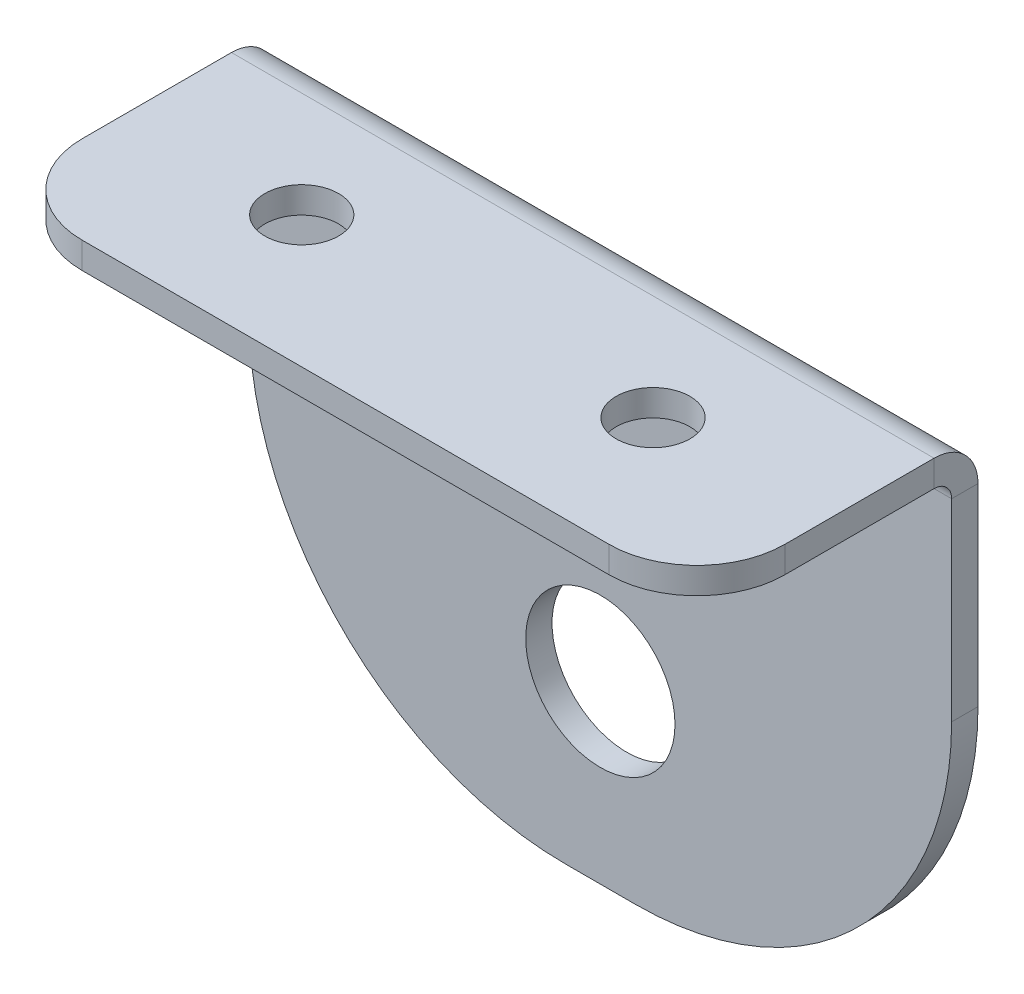
ISO-10303-21;
HEADER;
FILE_DESCRIPTION(('STEP AP214'),'2;1');
FILE_NAME('part.step','',(''),(''),'','','');
FILE_SCHEMA(('AUTOMOTIVE_DESIGN { 1 0 10303 214 1 1 1 1 }'));
ENDSEC;
DATA;
#1=APPLICATION_CONTEXT('core data for automotive mechanical design processes');
#2=APPLICATION_PROTOCOL_DEFINITION('international standard','automotive_design',2000,#1);
#3=PRODUCT_CONTEXT('',#1,'mechanical');
#4=PRODUCT('Part','Part','',(#3));
#5=PRODUCT_RELATED_PRODUCT_CATEGORY('part','',(#4));
#6=PRODUCT_DEFINITION_FORMATION('','',#4);
#7=PRODUCT_DEFINITION_CONTEXT('part definition',#1,'design');
#8=PRODUCT_DEFINITION('design','',#6,#7);
#9=PRODUCT_DEFINITION_SHAPE('','',#8);
#10=(LENGTH_UNIT() NAMED_UNIT(*) SI_UNIT(.MILLI.,.METRE.));
#11=(NAMED_UNIT(*) PLANE_ANGLE_UNIT() SI_UNIT($,.RADIAN.));
#12=(NAMED_UNIT(*) SI_UNIT($,.STERADIAN.) SOLID_ANGLE_UNIT());
#13=UNCERTAINTY_MEASURE_WITH_UNIT(LENGTH_MEASURE(1.E-05),#10,'distance_accuracy_value','');
#14=(GEOMETRIC_REPRESENTATION_CONTEXT(3) GLOBAL_UNCERTAINTY_ASSIGNED_CONTEXT((#13)) GLOBAL_UNIT_ASSIGNED_CONTEXT((#10,
#11,#12)) REPRESENTATION_CONTEXT('',''));
#15=CARTESIAN_POINT('',(0.,0.,0.));
#16=DIRECTION('',(0.,0.,1.));
#17=DIRECTION('',(1.,0.,0.));
#18=AXIS2_PLACEMENT_3D('',#15,#16,#17);
#19=CARTESIAN_POINT('',(-20.,21.5,-1.5));
#20=DIRECTION('',(-1.,0.,0.));
#21=DIRECTION('',(0.,-1.,0.));
#22=AXIS2_PLACEMENT_3D('',#19,#20,#21);
#23=PLANE('',#22);
#24=DIRECTION('',(0.,-1.,0.));
#25=VECTOR('',#24,1.);
#26=CARTESIAN_POINT('',(-20.,21.5,0.));
#27=LINE('',#26,#25);
#28=CARTESIAN_POINT('',(-20.,19.,0.));
#29=VERTEX_POINT('',#28);
#30=CARTESIAN_POINT('',(-20.,8.,0.));
#31=VERTEX_POINT('',#30);
#32=EDGE_CURVE('E254',#29,#31,#27,.T.);
#33=ORIENTED_EDGE('',*,*,#32,.F.);
#34=DIRECTION('',(0.,0.,-1.));
#35=VECTOR('',#34,1.);
#36=CARTESIAN_POINT('',(-20.,19.,0.));
#37=LINE('',#36,#35);
#38=CARTESIAN_POINT('',(-20.,19.,-1.5));
#39=VERTEX_POINT('',#38);
#40=EDGE_CURVE('E235',#29,#39,#37,.T.);
#41=ORIENTED_EDGE('',*,*,#40,.T.);
#42=DIRECTION('',(0.,-1.,0.));
#43=VECTOR('',#42,1.);
#44=CARTESIAN_POINT('',(-20.,21.5,-1.5));
#45=LINE('',#44,#43);
#46=CARTESIAN_POINT('',(-20.,8.,-1.5));
#47=VERTEX_POINT('',#46);
#48=EDGE_CURVE('E120',#39,#47,#45,.T.);
#49=ORIENTED_EDGE('',*,*,#48,.T.);
#50=DIRECTION('',(0.,0.,1.));
#51=VECTOR('',#50,1.);
#52=CARTESIAN_POINT('',(-20.,8.,-1.5));
#53=LINE('',#52,#51);
#54=EDGE_CURVE('E74',#47,#31,#53,.T.);
#55=ORIENTED_EDGE('',*,*,#54,.T.);
#56=EDGE_LOOP('',(#33,#41,#49,#55));
#57=FACE_BOUND('',#56,.T.);
#58=ADVANCED_FACE('F71',(#57),#23,.T.);
#59=CARTESIAN_POINT('',(-2.,8.,-1.5));
#60=DIRECTION('',(0.,0.,1.));
#61=DIRECTION('',(1.,0.,0.));
#62=AXIS2_PLACEMENT_3D('',#59,#60,#61);
#63=PLANE('',#62);
#64=CARTESIAN_POINT('',(0.,0.,-1.5));
#65=DIRECTION('',(0.,0.,1.));
#66=DIRECTION('',(1.,0.,0.));
#67=AXIS2_PLACEMENT_3D('',#64,#65,#66);
#68=CIRCLE('',#67,4.25);
#69=CARTESIAN_POINT('',(4.25,0.,-1.5));
#70=VERTEX_POINT('',#69);
#71=EDGE_CURVE('E251',#70,#70,#68,.T.);
#72=ORIENTED_EDGE('',*,*,#71,.T.);
#73=EDGE_LOOP('',(#72));
#74=FACE_BOUND('',#73,.T.);
#75=DIRECTION('',(-1.,0.,0.));
#76=VECTOR('',#75,1.);
#77=CARTESIAN_POINT('',(-20.,19.,-1.5));
#78=LINE('',#77,#76);
#79=CARTESIAN_POINT('',(20.,19.,-1.5));
#80=VERTEX_POINT('',#79);
#81=EDGE_CURVE('E229',#39,#80,#78,.F.);
#82=ORIENTED_EDGE('',*,*,#81,.T.);
#83=DIRECTION('',(0.,1.,0.));
#84=VECTOR('',#83,1.);
#85=CARTESIAN_POINT('',(20.,21.5,-1.5));
#86=LINE('',#85,#84);
#87=CARTESIAN_POINT('',(20.,8.,-1.5));
#88=VERTEX_POINT('',#87);
#89=EDGE_CURVE('E267',#88,#80,#86,.T.);
#90=ORIENTED_EDGE('',*,*,#89,.F.);
#91=CARTESIAN_POINT('',(2.,8.,-1.5));
#92=DIRECTION('',(0.,0.,1.));
#93=DIRECTION('',(1.,0.,0.));
#94=AXIS2_PLACEMENT_3D('',#91,#92,#93);
#95=CIRCLE('',#94,18.);
#96=CARTESIAN_POINT('',(2.,-10.,-1.5));
#97=VERTEX_POINT('',#96);
#98=EDGE_CURVE('E265',#97,#88,#95,.T.);
#99=ORIENTED_EDGE('',*,*,#98,.F.);
#100=DIRECTION('',(1.,0.,0.));
#101=VECTOR('',#100,1.);
#102=CARTESIAN_POINT('',(-2.,-10.,-1.5));
#103=LINE('',#102,#101);
#104=CARTESIAN_POINT('',(-2.,-10.,-1.5));
#105=VERTEX_POINT('',#104);
#106=EDGE_CURVE('E262',#105,#97,#103,.T.);
#107=ORIENTED_EDGE('',*,*,#106,.F.);
#108=CARTESIAN_POINT('',(-2.,8.,-1.5));
#109=DIRECTION('',(0.,0.,1.));
#110=DIRECTION('',(1.,0.,0.));
#111=AXIS2_PLACEMENT_3D('',#108,#109,#110);
#112=CIRCLE('',#111,18.);
#113=EDGE_CURVE('E258',#47,#105,#112,.T.);
#114=ORIENTED_EDGE('',*,*,#113,.F.);
#115=ORIENTED_EDGE('',*,*,#48,.F.);
#116=EDGE_LOOP('',(#82,#90,#99,#107,#114,#115));
#117=FACE_BOUND('',#116,.T.);
#118=ADVANCED_FACE('F303',(#74,#117),#63,.F.);
#119=CARTESIAN_POINT('',(-2.,8.,0.));
#120=DIRECTION('',(0.,0.,1.));
#121=DIRECTION('',(1.,0.,0.));
#122=AXIS2_PLACEMENT_3D('',#119,#120,#121);
#123=PLANE('',#122);
#124=CARTESIAN_POINT('',(0.,0.,0.));
#125=DIRECTION('',(0.,0.,1.));
#126=DIRECTION('',(1.,0.,0.));
#127=AXIS2_PLACEMENT_3D('',#124,#125,#126);
#128=CIRCLE('',#127,4.25);
#129=CARTESIAN_POINT('',(4.25,0.,0.));
#130=VERTEX_POINT('',#129);
#131=EDGE_CURVE('E249',#130,#130,#128,.T.);
#132=ORIENTED_EDGE('',*,*,#131,.F.);
#133=EDGE_LOOP('',(#132));
#134=FACE_BOUND('',#133,.T.);
#135=DIRECTION('',(0.,1.,0.));
#136=VECTOR('',#135,1.);
#137=CARTESIAN_POINT('',(20.,21.5,0.));
#138=LINE('',#137,#136);
#139=CARTESIAN_POINT('',(20.,8.,0.));
#140=VERTEX_POINT('',#139);
#141=CARTESIAN_POINT('',(20.,19.,0.));
#142=VERTEX_POINT('',#141);
#143=EDGE_CURVE('E259',#140,#142,#138,.T.);
#144=ORIENTED_EDGE('',*,*,#143,.T.);
#145=DIRECTION('',(-1.,0.,0.));
#146=VECTOR('',#145,1.);
#147=CARTESIAN_POINT('',(-20.,19.,0.));
#148=LINE('',#147,#146);
#149=EDGE_CURVE('E87',#29,#142,#148,.F.);
#150=ORIENTED_EDGE('',*,*,#149,.F.);
#151=ORIENTED_EDGE('',*,*,#32,.T.);
#152=CARTESIAN_POINT('',(-2.,8.,0.));
#153=DIRECTION('',(0.,0.,1.));
#154=DIRECTION('',(1.,0.,0.));
#155=AXIS2_PLACEMENT_3D('',#152,#153,#154);
#156=CIRCLE('',#155,18.);
#157=CARTESIAN_POINT('',(-2.,-10.,0.));
#158=VERTEX_POINT('',#157);
#159=EDGE_CURVE('E270',#31,#158,#156,.T.);
#160=ORIENTED_EDGE('',*,*,#159,.T.);
#161=DIRECTION('',(1.,0.,0.));
#162=VECTOR('',#161,1.);
#163=CARTESIAN_POINT('',(-2.,-10.,0.));
#164=LINE('',#163,#162);
#165=CARTESIAN_POINT('',(2.,-10.,0.));
#166=VERTEX_POINT('',#165);
#167=EDGE_CURVE('E273',#158,#166,#164,.T.);
#168=ORIENTED_EDGE('',*,*,#167,.T.);
#169=CARTESIAN_POINT('',(2.,8.,0.));
#170=DIRECTION('',(0.,0.,1.));
#171=DIRECTION('',(1.,0.,0.));
#172=AXIS2_PLACEMENT_3D('',#169,#170,#171);
#173=CIRCLE('',#172,18.);
#174=EDGE_CURVE('E276',#166,#140,#173,.T.);
#175=ORIENTED_EDGE('',*,*,#174,.T.);
#176=EDGE_LOOP('',(#144,#150,#151,#160,#168,#175));
#177=FACE_BOUND('',#176,.T.);
#178=ADVANCED_FACE('F287',(#134,#177),#123,.T.);
#179=CARTESIAN_POINT('',(20.,21.5,-1.5));
#180=DIRECTION('',(1.,0.,0.));
#181=DIRECTION('',(0.,1.,0.));
#182=AXIS2_PLACEMENT_3D('',#179,#180,#181);
#183=PLANE('',#182);
#184=DIRECTION('',(0.,0.,-1.));
#185=VECTOR('',#184,1.);
#186=CARTESIAN_POINT('',(20.,19.,0.));
#187=LINE('',#186,#185);
#188=EDGE_CURVE('E246',#142,#80,#187,.T.);
#189=ORIENTED_EDGE('',*,*,#188,.F.);
#190=ORIENTED_EDGE('',*,*,#143,.F.);
#191=DIRECTION('',(0.,0.,1.));
#192=VECTOR('',#191,1.);
#193=CARTESIAN_POINT('',(20.,8.,-1.5));
#194=LINE('',#193,#192);
#195=EDGE_CURVE('E13',#88,#140,#194,.T.);
#196=ORIENTED_EDGE('',*,*,#195,.F.);
#197=ORIENTED_EDGE('',*,*,#89,.T.);
#198=EDGE_LOOP('',(#189,#190,#196,#197));
#199=FACE_BOUND('',#198,.T.);
#200=ADVANCED_FACE('F294',(#199),#183,.T.);
#201=CARTESIAN_POINT('',(2.,8.,-1.5));
#202=DIRECTION('',(0.,0.,1.));
#203=DIRECTION('',(1.,0.,0.));
#204=AXIS2_PLACEMENT_3D('',#201,#202,#203);
#205=CYLINDRICAL_SURFACE('',#204,18.);
#206=ORIENTED_EDGE('',*,*,#174,.F.);
#207=DIRECTION('',(0.,0.,1.));
#208=VECTOR('',#207,1.);
#209=CARTESIAN_POINT('',(2.,-10.,-1.5));
#210=LINE('',#209,#208);
#211=EDGE_CURVE('E79',#97,#166,#210,.T.);
#212=ORIENTED_EDGE('',*,*,#211,.F.);
#213=ORIENTED_EDGE('',*,*,#98,.T.);
#214=ORIENTED_EDGE('',*,*,#195,.T.);
#215=EDGE_LOOP('',(#206,#212,#213,#214));
#216=FACE_BOUND('',#215,.T.);
#217=ADVANCED_FACE('F292',(#216),#205,.T.);
#218=CARTESIAN_POINT('',(-2.,-10.,-1.5));
#219=DIRECTION('',(0.,-1.,0.));
#220=DIRECTION('',(0.,0.,-1.));
#221=AXIS2_PLACEMENT_3D('',#218,#219,#220);
#222=PLANE('',#221);
#223=ORIENTED_EDGE('',*,*,#167,.F.);
#224=DIRECTION('',(0.,0.,1.));
#225=VECTOR('',#224,1.);
#226=CARTESIAN_POINT('',(-2.,-10.,-1.5));
#227=LINE('',#226,#225);
#228=EDGE_CURVE('E280',#105,#158,#227,.T.);
#229=ORIENTED_EDGE('',*,*,#228,.F.);
#230=ORIENTED_EDGE('',*,*,#106,.T.);
#231=ORIENTED_EDGE('',*,*,#211,.T.);
#232=EDGE_LOOP('',(#223,#229,#230,#231));
#233=FACE_BOUND('',#232,.T.);
#234=ADVANCED_FACE('F289',(#233),#222,.T.);
#235=CARTESIAN_POINT('',(-2.,8.,-1.5));
#236=DIRECTION('',(0.,0.,1.));
#237=DIRECTION('',(1.,0.,0.));
#238=AXIS2_PLACEMENT_3D('',#235,#236,#237);
#239=CYLINDRICAL_SURFACE('',#238,18.);
#240=ORIENTED_EDGE('',*,*,#159,.F.);
#241=ORIENTED_EDGE('',*,*,#54,.F.);
#242=ORIENTED_EDGE('',*,*,#113,.T.);
#243=ORIENTED_EDGE('',*,*,#228,.T.);
#244=EDGE_LOOP('',(#240,#241,#242,#243));
#245=FACE_BOUND('',#244,.T.);
#246=ADVANCED_FACE('F286',(#245),#239,.T.);
#247=CARTESIAN_POINT('',(0.,0.,-1.5));
#248=DIRECTION('',(0.,0.,1.));
#249=DIRECTION('',(1.,0.,0.));
#250=AXIS2_PLACEMENT_3D('',#247,#248,#249);
#251=CYLINDRICAL_SURFACE('',#250,4.25);
#252=ORIENTED_EDGE('',*,*,#71,.F.);
#253=EDGE_LOOP('',(#252));
#254=FACE_BOUND('',#253,.T.);
#255=ORIENTED_EDGE('',*,*,#131,.T.);
#256=EDGE_LOOP('',(#255));
#257=FACE_BOUND('',#256,.T.);
#258=ADVANCED_FACE('F316',(#254,#257),#251,.F.);
#259=CARTESIAN_POINT('',(20.,19.,1.));
#260=DIRECTION('',(1.,0.,0.));
#261=DIRECTION('',(0.,0.,-1.));
#262=AXIS2_PLACEMENT_3D('',#259,#260,#261);
#263=PLANE('',#262);
#264=DIRECTION('',(0.,-1.,0.));
#265=VECTOR('',#264,1.);
#266=CARTESIAN_POINT('',(20.,21.5,0.999999999999992));
#267=LINE('',#266,#265);
#268=CARTESIAN_POINT('',(20.,20.,0.999999999999997));
#269=VERTEX_POINT('',#268);
#270=CARTESIAN_POINT('',(20.,21.5,0.999999999999992));
#271=VERTEX_POINT('',#270);
#272=EDGE_CURVE('E193',#269,#271,#267,.F.);
#273=ORIENTED_EDGE('',*,*,#272,.F.);
#274=CARTESIAN_POINT('',(20.,19.,1.));
#275=DIRECTION('',(-1.,0.,0.));
#276=DIRECTION('',(0.,0.,1.));
#277=AXIS2_PLACEMENT_3D('',#274,#275,#276);
#278=CIRCLE('',#277,1.);
#279=EDGE_CURVE('E238',#142,#269,#278,.F.);
#280=ORIENTED_EDGE('',*,*,#279,.F.);
#281=ORIENTED_EDGE('',*,*,#188,.T.);
#282=CARTESIAN_POINT('',(20.,19.,1.));
#283=DIRECTION('',(-1.,0.,0.));
#284=DIRECTION('',(0.,0.,1.));
#285=AXIS2_PLACEMENT_3D('',#282,#283,#284);
#286=CIRCLE('',#285,2.5);
#287=EDGE_CURVE('E231',#80,#271,#286,.F.);
#288=ORIENTED_EDGE('',*,*,#287,.T.);
#289=EDGE_LOOP('',(#273,#280,#281,#288));
#290=FACE_BOUND('',#289,.T.);
#291=ADVANCED_FACE('F319',(#290),#263,.T.);
#292=CARTESIAN_POINT('',(-20.,19.,1.));
#293=DIRECTION('',(1.,0.,0.));
#294=DIRECTION('',(0.,0.,-1.));
#295=AXIS2_PLACEMENT_3D('',#292,#293,#294);
#296=PLANE('',#295);
#297=CARTESIAN_POINT('',(-20.,19.,1.));
#298=DIRECTION('',(-1.,0.,0.));
#299=DIRECTION('',(0.,0.,1.));
#300=AXIS2_PLACEMENT_3D('',#297,#298,#299);
#301=CIRCLE('',#300,1.);
#302=CARTESIAN_POINT('',(-20.,20.,1.));
#303=VERTEX_POINT('',#302);
#304=EDGE_CURVE('E242',#303,#29,#301,.T.);
#305=ORIENTED_EDGE('',*,*,#304,.F.);
#306=DIRECTION('',(0.,-1.,0.));
#307=VECTOR('',#306,1.);
#308=CARTESIAN_POINT('',(-20.,20.,1.));
#309=LINE('',#308,#307);
#310=CARTESIAN_POINT('',(-20.,21.5,0.999999999999996));
#311=VERTEX_POINT('',#310);
#312=EDGE_CURVE('E223',#303,#311,#309,.F.);
#313=ORIENTED_EDGE('',*,*,#312,.T.);
#314=CARTESIAN_POINT('',(-20.,19.,1.));
#315=DIRECTION('',(-1.,0.,0.));
#316=DIRECTION('',(0.,0.,1.));
#317=AXIS2_PLACEMENT_3D('',#314,#315,#316);
#318=CIRCLE('',#317,2.5);
#319=EDGE_CURVE('E232',#311,#39,#318,.T.);
#320=ORIENTED_EDGE('',*,*,#319,.T.);
#321=ORIENTED_EDGE('',*,*,#40,.F.);
#322=EDGE_LOOP('',(#305,#313,#320,#321));
#323=FACE_BOUND('',#322,.T.);
#324=ADVANCED_FACE('F321',(#323),#296,.F.);
#325=CARTESIAN_POINT('',(-20.,19.,1.));
#326=DIRECTION('',(-1.,0.,0.));
#327=DIRECTION('',(0.,1.,0.));
#328=AXIS2_PLACEMENT_3D('',#325,#326,#327);
#329=CYLINDRICAL_SURFACE('',#328,2.5);
#330=ORIENTED_EDGE('',*,*,#81,.F.);
#331=ORIENTED_EDGE('',*,*,#319,.F.);
#332=DIRECTION('',(-1.,0.,0.));
#333=VECTOR('',#332,1.);
#334=CARTESIAN_POINT('',(20.,21.5,0.999999999999992));
#335=LINE('',#334,#333);
#336=EDGE_CURVE('E221',#311,#271,#335,.F.);
#337=ORIENTED_EDGE('',*,*,#336,.T.);
#338=ORIENTED_EDGE('',*,*,#287,.F.);
#339=EDGE_LOOP('',(#330,#331,#337,#338));
#340=FACE_BOUND('',#339,.T.);
#341=ADVANCED_FACE('F324',(#340),#329,.T.);
#342=CARTESIAN_POINT('',(-20.,19.,1.));
#343=DIRECTION('',(-1.,0.,0.));
#344=DIRECTION('',(0.,1.,0.));
#345=AXIS2_PLACEMENT_3D('',#342,#343,#344);
#346=CYLINDRICAL_SURFACE('',#345,1.);
#347=ORIENTED_EDGE('',*,*,#149,.T.);
#348=ORIENTED_EDGE('',*,*,#279,.T.);
#349=DIRECTION('',(-1.,0.,0.));
#350=VECTOR('',#349,1.);
#351=CARTESIAN_POINT('',(20.,20.,0.999999999999997));
#352=LINE('',#351,#350);
#353=EDGE_CURVE('E226',#269,#303,#352,.T.);
#354=ORIENTED_EDGE('',*,*,#353,.T.);
#355=ORIENTED_EDGE('',*,*,#304,.T.);
#356=EDGE_LOOP('',(#347,#348,#354,#355));
#357=FACE_BOUND('',#356,.T.);
#358=ADVANCED_FACE('F329',(#357),#346,.F.);
#359=CARTESIAN_POINT('',(15.,21.5,9.5));
#360=DIRECTION('',(0.,-1.,0.));
#361=DIRECTION('',(0.,0.,-1.));
#362=AXIS2_PLACEMENT_3D('',#359,#360,#361);
#363=PLANE('',#362);
#364=CARTESIAN_POINT('',(-10.,21.5,7.));
#365=DIRECTION('',(0.,-1.,0.));
#366=DIRECTION('',(0.,0.,-1.));
#367=AXIS2_PLACEMENT_3D('',#364,#365,#366);
#368=CIRCLE('',#367,2.1);
#369=CARTESIAN_POINT('',(-10.,21.5,4.9));
#370=VERTEX_POINT('',#369);
#371=EDGE_CURVE('E215',#370,#370,#368,.F.);
#372=ORIENTED_EDGE('',*,*,#371,.F.);
#373=EDGE_LOOP('',(#372));
#374=FACE_BOUND('',#373,.T.);
#375=CARTESIAN_POINT('',(10.,21.5,7.));
#376=DIRECTION('',(0.,-1.,0.));
#377=DIRECTION('',(0.,0.,-1.));
#378=AXIS2_PLACEMENT_3D('',#375,#376,#377);
#379=CIRCLE('',#378,2.1);
#380=CARTESIAN_POINT('',(10.,21.5,4.9));
#381=VERTEX_POINT('',#380);
#382=EDGE_CURVE('E209',#381,#381,#379,.F.);
#383=ORIENTED_EDGE('',*,*,#382,.F.);
#384=EDGE_LOOP('',(#383));
#385=FACE_BOUND('',#384,.T.);
#386=ORIENTED_EDGE('',*,*,#336,.F.);
#387=DIRECTION('',(0.,0.,1.));
#388=VECTOR('',#387,1.);
#389=CARTESIAN_POINT('',(-20.,21.5,9.5));
#390=LINE('',#389,#388);
#391=CARTESIAN_POINT('',(-20.,21.5,9.49999999999998));
#392=VERTEX_POINT('',#391);
#393=EDGE_CURVE('E194',#311,#392,#390,.T.);
#394=ORIENTED_EDGE('',*,*,#393,.T.);
#395=CARTESIAN_POINT('',(-15.,21.5,9.5));
#396=DIRECTION('',(0.,-1.,0.));
#397=DIRECTION('',(0.,0.,-1.));
#398=AXIS2_PLACEMENT_3D('',#395,#396,#397);
#399=CIRCLE('',#398,5.);
#400=CARTESIAN_POINT('',(-15.,21.5,14.5));
#401=VERTEX_POINT('',#400);
#402=EDGE_CURVE('E196',#392,#401,#399,.F.);
#403=ORIENTED_EDGE('',*,*,#402,.T.);
#404=DIRECTION('',(1.,0.,0.));
#405=VECTOR('',#404,1.);
#406=CARTESIAN_POINT('',(15.,21.5,14.5));
#407=LINE('',#406,#405);
#408=CARTESIAN_POINT('',(15.,21.5,14.5));
#409=VERTEX_POINT('',#408);
#410=EDGE_CURVE('E176',#401,#409,#407,.T.);
#411=ORIENTED_EDGE('',*,*,#410,.T.);
#412=CARTESIAN_POINT('',(15.,21.5,9.5));
#413=DIRECTION('',(0.,-1.,0.));
#414=DIRECTION('',(0.,0.,-1.));
#415=AXIS2_PLACEMENT_3D('',#412,#413,#414);
#416=CIRCLE('',#415,5.);
#417=CARTESIAN_POINT('',(20.,21.5,9.49999999999998));
#418=VERTEX_POINT('',#417);
#419=EDGE_CURVE('E169',#409,#418,#416,.F.);
#420=ORIENTED_EDGE('',*,*,#419,.T.);
#421=DIRECTION('',(0.,0.,-1.));
#422=VECTOR('',#421,1.);
#423=CARTESIAN_POINT('',(20.,21.5,9.5));
#424=LINE('',#423,#422);
#425=EDGE_CURVE('E174',#418,#271,#424,.T.);
#426=ORIENTED_EDGE('',*,*,#425,.T.);
#427=EDGE_LOOP('',(#386,#394,#403,#411,#420,#426));
#428=FACE_BOUND('',#427,.T.);
#429=ADVANCED_FACE('F172',(#374,#385,#428),#363,.F.);
#430=CARTESIAN_POINT('',(15.,20.,9.50000000000001));
#431=DIRECTION('',(0.,-1.,0.));
#432=DIRECTION('',(0.,0.,-1.));
#433=AXIS2_PLACEMENT_3D('',#430,#431,#432);
#434=PLANE('',#433);
#435=CARTESIAN_POINT('',(10.,20.,7.));
#436=DIRECTION('',(0.,-1.,0.));
#437=DIRECTION('',(0.,0.,-1.));
#438=AXIS2_PLACEMENT_3D('',#435,#436,#437);
#439=CIRCLE('',#438,2.1);
#440=CARTESIAN_POINT('',(10.,20.,4.9));
#441=VERTEX_POINT('',#440);
#442=EDGE_CURVE('E212',#441,#441,#439,.F.);
#443=ORIENTED_EDGE('',*,*,#442,.T.);
#444=EDGE_LOOP('',(#443));
#445=FACE_BOUND('',#444,.T.);
#446=CARTESIAN_POINT('',(-10.,20.,7.));
#447=DIRECTION('',(0.,-1.,0.));
#448=DIRECTION('',(0.,0.,-1.));
#449=AXIS2_PLACEMENT_3D('',#446,#447,#448);
#450=CIRCLE('',#449,2.1);
#451=CARTESIAN_POINT('',(-10.,20.,4.9));
#452=VERTEX_POINT('',#451);
#453=EDGE_CURVE('E218',#452,#452,#450,.F.);
#454=ORIENTED_EDGE('',*,*,#453,.T.);
#455=EDGE_LOOP('',(#454));
#456=FACE_BOUND('',#455,.T.);
#457=DIRECTION('',(0.,0.,-1.));
#458=VECTOR('',#457,1.);
#459=CARTESIAN_POINT('',(-20.,20.,9.49999999999997));
#460=LINE('',#459,#458);
#461=CARTESIAN_POINT('',(-20.,20.,9.49999999999999));
#462=VERTEX_POINT('',#461);
#463=EDGE_CURVE('E205',#303,#462,#460,.F.);
#464=ORIENTED_EDGE('',*,*,#463,.F.);
#465=ORIENTED_EDGE('',*,*,#353,.F.);
#466=DIRECTION('',(0.,0.,1.));
#467=VECTOR('',#466,1.);
#468=CARTESIAN_POINT('',(20.,20.,0.));
#469=LINE('',#468,#467);
#470=CARTESIAN_POINT('',(20.,20.,9.49999999999999));
#471=VERTEX_POINT('',#470);
#472=EDGE_CURVE('E207',#471,#269,#469,.F.);
#473=ORIENTED_EDGE('',*,*,#472,.F.);
#474=CARTESIAN_POINT('',(15.,20.,9.50000000000001));
#475=DIRECTION('',(0.,-1.,0.));
#476=DIRECTION('',(0.,0.,-1.));
#477=AXIS2_PLACEMENT_3D('',#474,#475,#476);
#478=CIRCLE('',#477,5.);
#479=CARTESIAN_POINT('',(15.,20.,14.5));
#480=VERTEX_POINT('',#479);
#481=EDGE_CURVE('E185',#480,#471,#478,.F.);
#482=ORIENTED_EDGE('',*,*,#481,.F.);
#483=DIRECTION('',(-1.,0.,0.));
#484=VECTOR('',#483,1.);
#485=CARTESIAN_POINT('',(15.,20.,14.5));
#486=LINE('',#485,#484);
#487=CARTESIAN_POINT('',(-15.,20.,14.5));
#488=VERTEX_POINT('',#487);
#489=EDGE_CURVE('E198',#488,#480,#486,.F.);
#490=ORIENTED_EDGE('',*,*,#489,.F.);
#491=CARTESIAN_POINT('',(-15.,20.,9.50000000000001));
#492=DIRECTION('',(0.,-1.,0.));
#493=DIRECTION('',(0.,0.,-1.));
#494=AXIS2_PLACEMENT_3D('',#491,#492,#493);
#495=CIRCLE('',#494,5.);
#496=EDGE_CURVE('E203',#462,#488,#495,.F.);
#497=ORIENTED_EDGE('',*,*,#496,.F.);
#498=EDGE_LOOP('',(#464,#465,#473,#482,#490,#497));
#499=FACE_BOUND('',#498,.T.);
#500=ADVANCED_FACE('F339',(#445,#456,#499),#434,.T.);
#501=CARTESIAN_POINT('',(20.,21.5,0.));
#502=DIRECTION('',(-1.,0.,0.));
#503=DIRECTION('',(0.,0.,1.));
#504=AXIS2_PLACEMENT_3D('',#501,#502,#503);
#505=PLANE('',#504);
#506=ORIENTED_EDGE('',*,*,#272,.T.);
#507=ORIENTED_EDGE('',*,*,#425,.F.);
#508=DIRECTION('',(0.,-1.,0.));
#509=VECTOR('',#508,1.);
#510=CARTESIAN_POINT('',(20.,21.5,9.49999999999996));
#511=LINE('',#510,#509);
#512=EDGE_CURVE('E180',#418,#471,#511,.T.);
#513=ORIENTED_EDGE('',*,*,#512,.T.);
#514=ORIENTED_EDGE('',*,*,#472,.T.);
#515=EDGE_LOOP('',(#506,#507,#513,#514));
#516=FACE_BOUND('',#515,.T.);
#517=ADVANCED_FACE('F192',(#516),#505,.F.);
#518=CARTESIAN_POINT('',(-20.,21.5,9.49999999999996));
#519=DIRECTION('',(1.,0.,0.));
#520=DIRECTION('',(0.,0.,-1.));
#521=AXIS2_PLACEMENT_3D('',#518,#519,#520);
#522=PLANE('',#521);
#523=ORIENTED_EDGE('',*,*,#312,.F.);
#524=ORIENTED_EDGE('',*,*,#463,.T.);
#525=DIRECTION('',(0.,-1.,0.));
#526=VECTOR('',#525,1.);
#527=CARTESIAN_POINT('',(-20.,21.5,9.49999999999996));
#528=LINE('',#527,#526);
#529=EDGE_CURVE('E245',#392,#462,#528,.T.);
#530=ORIENTED_EDGE('',*,*,#529,.F.);
#531=ORIENTED_EDGE('',*,*,#393,.F.);
#532=EDGE_LOOP('',(#523,#524,#530,#531));
#533=FACE_BOUND('',#532,.T.);
#534=ADVANCED_FACE('F338',(#533),#522,.F.);
#535=CARTESIAN_POINT('',(-15.,21.5,9.5));
#536=DIRECTION('',(0.,-1.,0.));
#537=DIRECTION('',(0.,0.,-1.));
#538=AXIS2_PLACEMENT_3D('',#535,#536,#537);
#539=CYLINDRICAL_SURFACE('',#538,5.);
#540=ORIENTED_EDGE('',*,*,#496,.T.);
#541=DIRECTION('',(0.,-1.,0.));
#542=VECTOR('',#541,1.);
#543=CARTESIAN_POINT('',(-15.,21.5,14.5));
#544=LINE('',#543,#542);
#545=EDGE_CURVE('E384',#401,#488,#544,.T.);
#546=ORIENTED_EDGE('',*,*,#545,.F.);
#547=ORIENTED_EDGE('',*,*,#402,.F.);
#548=ORIENTED_EDGE('',*,*,#529,.T.);
#549=EDGE_LOOP('',(#540,#546,#547,#548));
#550=FACE_BOUND('',#549,.T.);
#551=ADVANCED_FACE('F342',(#550),#539,.T.);
#552=CARTESIAN_POINT('',(15.,21.5,14.5));
#553=DIRECTION('',(0.,0.,-1.));
#554=DIRECTION('',(0.,1.,0.));
#555=AXIS2_PLACEMENT_3D('',#552,#553,#554);
#556=PLANE('',#555);
#557=ORIENTED_EDGE('',*,*,#489,.T.);
#558=DIRECTION('',(0.,-1.,0.));
#559=VECTOR('',#558,1.);
#560=CARTESIAN_POINT('',(15.,21.5,14.5));
#561=LINE('',#560,#559);
#562=EDGE_CURVE('E189',#409,#480,#561,.T.);
#563=ORIENTED_EDGE('',*,*,#562,.F.);
#564=ORIENTED_EDGE('',*,*,#410,.F.);
#565=ORIENTED_EDGE('',*,*,#545,.T.);
#566=EDGE_LOOP('',(#557,#563,#564,#565));
#567=FACE_BOUND('',#566,.T.);
#568=ADVANCED_FACE('F346',(#567),#556,.F.);
#569=CARTESIAN_POINT('',(15.,21.5,9.5));
#570=DIRECTION('',(0.,-1.,0.));
#571=DIRECTION('',(0.,0.,-1.));
#572=AXIS2_PLACEMENT_3D('',#569,#570,#571);
#573=CYLINDRICAL_SURFACE('',#572,5.);
#574=ORIENTED_EDGE('',*,*,#481,.T.);
#575=ORIENTED_EDGE('',*,*,#512,.F.);
#576=ORIENTED_EDGE('',*,*,#419,.F.);
#577=ORIENTED_EDGE('',*,*,#562,.T.);
#578=EDGE_LOOP('',(#574,#575,#576,#577));
#579=FACE_BOUND('',#578,.T.);
#580=ADVANCED_FACE('F183',(#579),#573,.T.);
#581=CARTESIAN_POINT('',(10.,21.5,7.));
#582=DIRECTION('',(0.,-1.,0.));
#583=DIRECTION('',(0.,0.,-1.));
#584=AXIS2_PLACEMENT_3D('',#581,#582,#583);
#585=CYLINDRICAL_SURFACE('',#584,2.1);
#586=ORIENTED_EDGE('',*,*,#382,.T.);
#587=EDGE_LOOP('',(#586));
#588=FACE_BOUND('',#587,.T.);
#589=ORIENTED_EDGE('',*,*,#442,.F.);
#590=EDGE_LOOP('',(#589));
#591=FACE_BOUND('',#590,.T.);
#592=ADVANCED_FACE('F353',(#588,#591),#585,.F.);
#593=CARTESIAN_POINT('',(-10.,21.5,7.));
#594=DIRECTION('',(0.,-1.,0.));
#595=DIRECTION('',(0.,0.,-1.));
#596=AXIS2_PLACEMENT_3D('',#593,#594,#595);
#597=CYLINDRICAL_SURFACE('',#596,2.1);
#598=ORIENTED_EDGE('',*,*,#371,.T.);
#599=EDGE_LOOP('',(#598));
#600=FACE_BOUND('',#599,.T.);
#601=ORIENTED_EDGE('',*,*,#453,.F.);
#602=EDGE_LOOP('',(#601));
#603=FACE_BOUND('',#602,.T.);
#604=ADVANCED_FACE('F362',(#600,#603),#597,.F.);
#605=CLOSED_SHELL('',(#58,#118,#178,#200,#217,#234,#246,#258,#291,#324,#341,#358,#429,#500,#517,
#534,#551,#568,#580,#592,#604));
#606=MANIFOLD_SOLID_BREP('B2',#605);
#607=ADVANCED_BREP_SHAPE_REPRESENTATION('',(#18,#606),#14);
#608=SHAPE_DEFINITION_REPRESENTATION(#9,#607);
ENDSEC;
END-ISO-10303-21;
